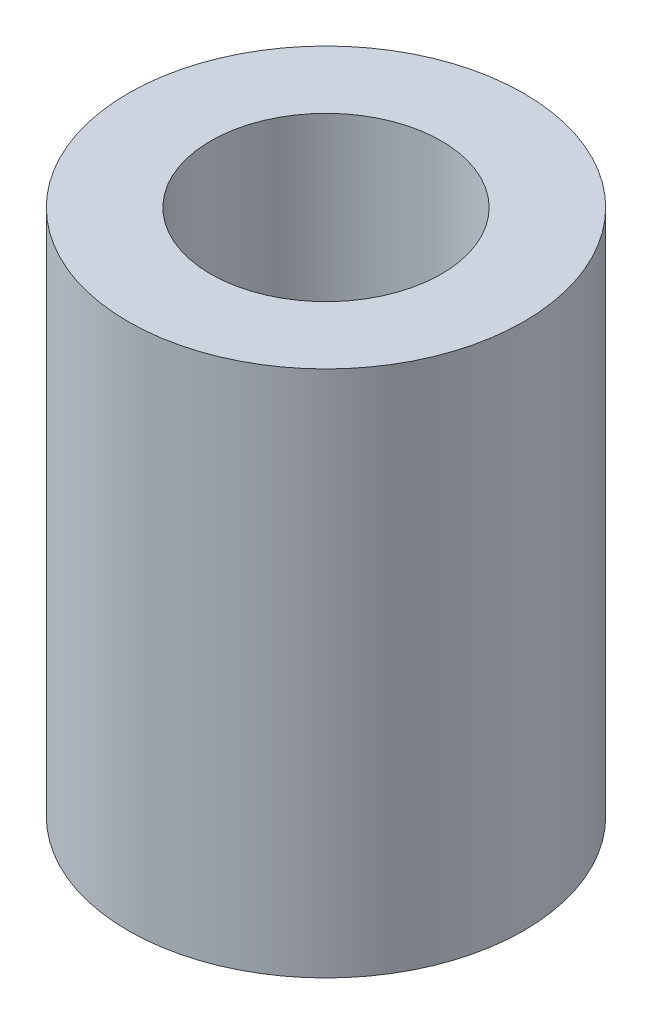
ISO-10303-21;
HEADER;
FILE_DESCRIPTION(('STEP AP214'),'2;1');
FILE_NAME('part.step','',(''),(''),'','','');
FILE_SCHEMA(('AUTOMOTIVE_DESIGN { 1 0 10303 214 1 1 1 1 }'));
ENDSEC;
DATA;
#1=APPLICATION_CONTEXT('core data for automotive mechanical design processes');
#2=APPLICATION_PROTOCOL_DEFINITION('international standard','automotive_design',2000,#1);
#3=PRODUCT_CONTEXT('',#1,'mechanical');
#4=PRODUCT('Part','Part','',(#3));
#5=PRODUCT_RELATED_PRODUCT_CATEGORY('part','',(#4));
#6=PRODUCT_DEFINITION_FORMATION('','',#4);
#7=PRODUCT_DEFINITION_CONTEXT('part definition',#1,'design');
#8=PRODUCT_DEFINITION('design','',#6,#7);
#9=PRODUCT_DEFINITION_SHAPE('','',#8);
#10=(LENGTH_UNIT() NAMED_UNIT(*) SI_UNIT(.MILLI.,.METRE.));
#11=(NAMED_UNIT(*) PLANE_ANGLE_UNIT() SI_UNIT($,.RADIAN.));
#12=(NAMED_UNIT(*) SI_UNIT($,.STERADIAN.) SOLID_ANGLE_UNIT());
#13=UNCERTAINTY_MEASURE_WITH_UNIT(LENGTH_MEASURE(1.E-05),#10,'distance_accuracy_value','');
#14=(GEOMETRIC_REPRESENTATION_CONTEXT(3) GLOBAL_UNCERTAINTY_ASSIGNED_CONTEXT((#13)) GLOBAL_UNIT_ASSIGNED_CONTEXT((#10,
#11,#12)) REPRESENTATION_CONTEXT('',''));
#15=CARTESIAN_POINT('',(0.,0.,0.));
#16=DIRECTION('',(0.,0.,1.));
#17=DIRECTION('',(1.,0.,0.));
#18=AXIS2_PLACEMENT_3D('',#15,#16,#17);
#19=CARTESIAN_POINT('',(0.,4.,0.));
#20=DIRECTION('',(0.,1.,0.));
#21=DIRECTION('',(0.,0.,1.));
#22=AXIS2_PLACEMENT_3D('',#19,#20,#21);
#23=PLANE('',#22);
#24=CARTESIAN_POINT('',(0.,4.,0.));
#25=DIRECTION('',(0.,1.,0.));
#26=DIRECTION('',(0.,0.,1.));
#27=AXIS2_PLACEMENT_3D('',#24,#25,#26);
#28=CIRCLE('',#27,3.);
#29=CARTESIAN_POINT('',(0.,4.,3.));
#30=VERTEX_POINT('',#29);
#31=EDGE_CURVE('E10',#30,#30,#28,.T.);
#32=ORIENTED_EDGE('',*,*,#31,.T.);
#33=EDGE_LOOP('',(#32));
#34=FACE_BOUND('',#33,.T.);
#35=CARTESIAN_POINT('',(0.,4.,0.));
#36=DIRECTION('',(0.,1.,0.));
#37=DIRECTION('',(0.,0.,1.));
#38=AXIS2_PLACEMENT_3D('',#35,#36,#37);
#39=CIRCLE('',#38,1.75);
#40=CARTESIAN_POINT('',(0.,4.,1.75));
#41=VERTEX_POINT('',#40);
#42=EDGE_CURVE('E48',#41,#41,#39,.T.);
#43=ORIENTED_EDGE('',*,*,#42,.F.);
#44=EDGE_LOOP('',(#43));
#45=FACE_BOUND('',#44,.T.);
#46=ADVANCED_FACE('F37',(#34,#45),#23,.T.);
#47=CARTESIAN_POINT('',(0.,-4.,0.));
#48=DIRECTION('',(0.,1.,0.));
#49=DIRECTION('',(0.,0.,1.));
#50=AXIS2_PLACEMENT_3D('',#47,#48,#49);
#51=PLANE('',#50);
#52=CARTESIAN_POINT('',(0.,-4.,0.));
#53=DIRECTION('',(0.,1.,0.));
#54=DIRECTION('',(0.,0.,1.));
#55=AXIS2_PLACEMENT_3D('',#52,#53,#54);
#56=CIRCLE('',#55,3.);
#57=CARTESIAN_POINT('',(0.,-4.,3.));
#58=VERTEX_POINT('',#57);
#59=EDGE_CURVE('E41',#58,#58,#56,.T.);
#60=ORIENTED_EDGE('',*,*,#59,.F.);
#61=EDGE_LOOP('',(#60));
#62=FACE_BOUND('',#61,.T.);
#63=CARTESIAN_POINT('',(0.,-4.,0.));
#64=DIRECTION('',(0.,1.,0.));
#65=DIRECTION('',(0.,0.,1.));
#66=AXIS2_PLACEMENT_3D('',#63,#64,#65);
#67=CIRCLE('',#66,1.75);
#68=CARTESIAN_POINT('',(0.,-4.,1.75));
#69=VERTEX_POINT('',#68);
#70=EDGE_CURVE('E50',#69,#69,#67,.T.);
#71=ORIENTED_EDGE('',*,*,#70,.T.);
#72=EDGE_LOOP('',(#71));
#73=FACE_BOUND('',#72,.T.);
#74=ADVANCED_FACE('F60',(#62,#73),#51,.F.);
#75=CARTESIAN_POINT('',(0.,4.,0.));
#76=DIRECTION('',(0.,-1.,0.));
#77=DIRECTION('',(0.,0.,-1.));
#78=AXIS2_PLACEMENT_3D('',#75,#76,#77);
#79=CYLINDRICAL_SURFACE('',#78,3.);
#80=ORIENTED_EDGE('',*,*,#31,.F.);
#81=EDGE_LOOP('',(#80));
#82=FACE_BOUND('',#81,.T.);
#83=ORIENTED_EDGE('',*,*,#59,.T.);
#84=EDGE_LOOP('',(#83));
#85=FACE_BOUND('',#84,.T.);
#86=ADVANCED_FACE('F39',(#82,#85),#79,.T.);
#87=CARTESIAN_POINT('',(0.,4.,0.));
#88=DIRECTION('',(0.,-1.,0.));
#89=DIRECTION('',(0.,0.,-1.));
#90=AXIS2_PLACEMENT_3D('',#87,#88,#89);
#91=CYLINDRICAL_SURFACE('',#90,1.75);
#92=ORIENTED_EDGE('',*,*,#42,.T.);
#93=EDGE_LOOP('',(#92));
#94=FACE_BOUND('',#93,.T.);
#95=ORIENTED_EDGE('',*,*,#70,.F.);
#96=EDGE_LOOP('',(#95));
#97=FACE_BOUND('',#96,.T.);
#98=ADVANCED_FACE('F56',(#94,#97),#91,.F.);
#99=CLOSED_SHELL('',(#46,#74,#86,#98));
#100=MANIFOLD_SOLID_BREP('B2',#99);
#101=ADVANCED_BREP_SHAPE_REPRESENTATION('',(#18,#100),#14);
#102=SHAPE_DEFINITION_REPRESENTATION(#9,#101);
ENDSEC;
END-ISO-10303-21;
